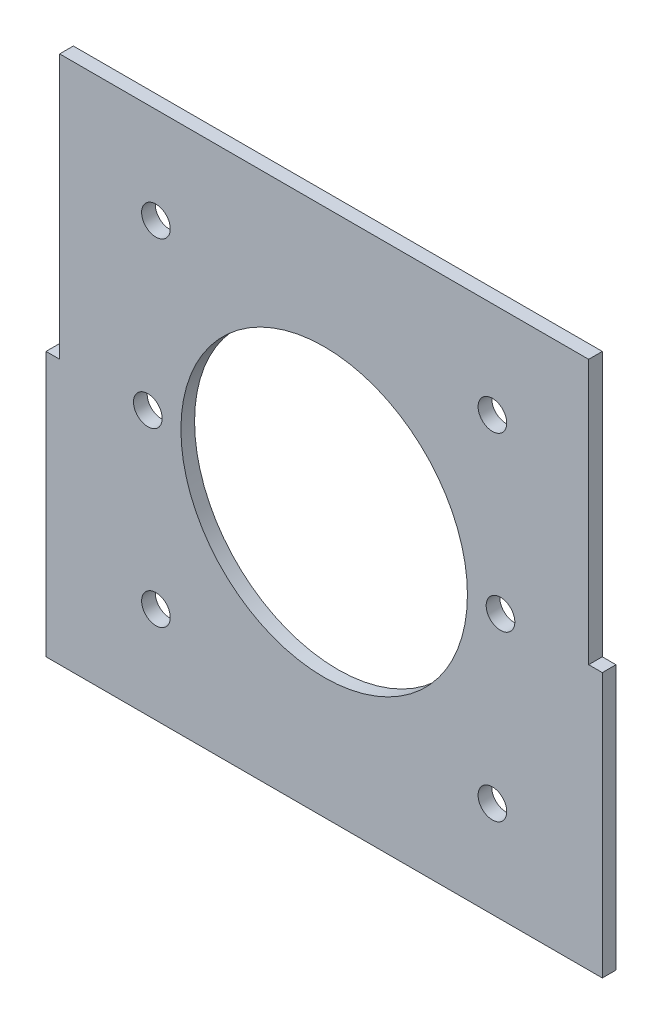
ISO-10303-21;
HEADER;
FILE_DESCRIPTION(('STEP AP214'),'2;1');
FILE_NAME('part.step','',(''),(''),'','','');
FILE_SCHEMA(('AUTOMOTIVE_DESIGN { 1 0 10303 214 1 1 1 1 }'));
ENDSEC;
DATA;
#1=APPLICATION_CONTEXT('core data for automotive mechanical design processes');
#2=APPLICATION_PROTOCOL_DEFINITION('international standard','automotive_design',2000,#1);
#3=PRODUCT_CONTEXT('',#1,'mechanical');
#4=PRODUCT('Part','Part','',(#3));
#5=PRODUCT_RELATED_PRODUCT_CATEGORY('part','',(#4));
#6=PRODUCT_DEFINITION_FORMATION('','',#4);
#7=PRODUCT_DEFINITION_CONTEXT('part definition',#1,'design');
#8=PRODUCT_DEFINITION('design','',#6,#7);
#9=PRODUCT_DEFINITION_SHAPE('','',#8);
#10=(LENGTH_UNIT() NAMED_UNIT(*) SI_UNIT(.MILLI.,.METRE.));
#11=(NAMED_UNIT(*) PLANE_ANGLE_UNIT() SI_UNIT($,.RADIAN.));
#12=(NAMED_UNIT(*) SI_UNIT($,.STERADIAN.) SOLID_ANGLE_UNIT());
#13=UNCERTAINTY_MEASURE_WITH_UNIT(LENGTH_MEASURE(1.E-05),#10,'distance_accuracy_value','');
#14=(GEOMETRIC_REPRESENTATION_CONTEXT(3) GLOBAL_UNCERTAINTY_ASSIGNED_CONTEXT((#13)) GLOBAL_UNIT_ASSIGNED_CONTEXT((#10,
#11,#12)) REPRESENTATION_CONTEXT('',''));
#15=CARTESIAN_POINT('',(0.,0.,0.));
#16=DIRECTION('',(0.,0.,1.));
#17=DIRECTION('',(1.,0.,0.));
#18=AXIS2_PLACEMENT_3D('',#15,#16,#17);
#19=CARTESIAN_POINT('',(60.,-60.,3.1));
#20=DIRECTION('',(-1.,0.,0.));
#21=DIRECTION('',(0.,-1.,0.));
#22=AXIS2_PLACEMENT_3D('',#19,#20,#21);
#23=PLANE('',#22);
#24=DIRECTION('',(0.,0.,1.));
#25=VECTOR('',#24,1.);
#26=CARTESIAN_POINT('',(60.,0.,0.));
#27=LINE('',#26,#25);
#28=CARTESIAN_POINT('',(60.,0.,0.));
#29=VERTEX_POINT('',#28);
#30=CARTESIAN_POINT('',(60.,0.,3.1));
#31=VERTEX_POINT('',#30);
#32=EDGE_CURVE('E56',#29,#31,#27,.T.);
#33=ORIENTED_EDGE('',*,*,#32,.F.);
#34=DIRECTION('',(0.,1.,0.));
#35=VECTOR('',#34,1.);
#36=CARTESIAN_POINT('',(60.,-60.,0.));
#37=LINE('',#36,#35);
#38=CARTESIAN_POINT('',(60.,60.,0.));
#39=VERTEX_POINT('',#38);
#40=EDGE_CURVE('E177',#29,#39,#37,.T.);
#41=ORIENTED_EDGE('',*,*,#40,.T.);
#42=DIRECTION('',(0.,0.,-1.));
#43=VECTOR('',#42,1.);
#44=CARTESIAN_POINT('',(60.,60.,3.1));
#45=LINE('',#44,#43);
#46=CARTESIAN_POINT('',(60.,60.,3.1));
#47=VERTEX_POINT('',#46);
#48=EDGE_CURVE('E11',#47,#39,#45,.T.);
#49=ORIENTED_EDGE('',*,*,#48,.F.);
#50=DIRECTION('',(0.,1.,0.));
#51=VECTOR('',#50,1.);
#52=CARTESIAN_POINT('',(60.,-60.,3.1));
#53=LINE('',#52,#51);
#54=EDGE_CURVE('E153',#31,#47,#53,.T.);
#55=ORIENTED_EDGE('',*,*,#54,.F.);
#56=EDGE_LOOP('',(#33,#41,#49,#55));
#57=FACE_BOUND('',#56,.T.);
#58=ADVANCED_FACE('F32',(#57),#23,.F.);
#59=CARTESIAN_POINT('',(0.,0.,3.1));
#60=DIRECTION('',(0.,0.,-1.));
#61=DIRECTION('',(-1.,0.,0.));
#62=AXIS2_PLACEMENT_3D('',#59,#60,#61);
#63=PLANE('',#62);
#64=CARTESIAN_POINT('',(0.,0.,3.1));
#65=DIRECTION('',(0.,0.,1.));
#66=DIRECTION('',(1.,0.,0.));
#67=AXIS2_PLACEMENT_3D('',#64,#65,#66);
#68=CIRCLE('',#67,32.5);
#69=CARTESIAN_POINT('',(32.5,0.,3.1));
#70=VERTEX_POINT('',#69);
#71=EDGE_CURVE('E419',#70,#70,#68,.T.);
#72=ORIENTED_EDGE('',*,*,#71,.F.);
#73=EDGE_LOOP('',(#72));
#74=FACE_BOUND('',#73,.T.);
#75=CARTESIAN_POINT('',(-40.,0.,3.1));
#76=DIRECTION('',(0.,0.,1.));
#77=DIRECTION('',(1.,0.,0.));
#78=AXIS2_PLACEMENT_3D('',#75,#76,#77);
#79=CIRCLE('',#78,3.25);
#80=CARTESIAN_POINT('',(-36.75,0.,3.1));
#81=VERTEX_POINT('',#80);
#82=EDGE_CURVE('E207',#81,#81,#79,.T.);
#83=ORIENTED_EDGE('',*,*,#82,.F.);
#84=EDGE_LOOP('',(#83));
#85=FACE_BOUND('',#84,.T.);
#86=CARTESIAN_POINT('',(38.1660885145439,-38.1660885145439,3.1));
#87=DIRECTION('',(0.,0.,1.));
#88=DIRECTION('',(1.,0.,0.));
#89=AXIS2_PLACEMENT_3D('',#86,#87,#88);
#90=CIRCLE('',#89,3.25);
#91=CARTESIAN_POINT('',(41.4160885145439,-38.1660885145439,3.1));
#92=VERTEX_POINT('',#91);
#93=EDGE_CURVE('E195',#92,#92,#90,.T.);
#94=ORIENTED_EDGE('',*,*,#93,.F.);
#95=EDGE_LOOP('',(#94));
#96=FACE_BOUND('',#95,.T.);
#97=CARTESIAN_POINT('',(-38.1660885145439,38.1660885145439,3.1));
#98=DIRECTION('',(0.,0.,1.));
#99=DIRECTION('',(1.,0.,0.));
#100=AXIS2_PLACEMENT_3D('',#97,#98,#99);
#101=CIRCLE('',#100,3.25);
#102=CARTESIAN_POINT('',(-34.9160885145439,38.1660885145439,3.1));
#103=VERTEX_POINT('',#102);
#104=EDGE_CURVE('E178',#103,#103,#101,.T.);
#105=ORIENTED_EDGE('',*,*,#104,.F.);
#106=EDGE_LOOP('',(#105));
#107=FACE_BOUND('',#106,.T.);
#108=DIRECTION('',(1.,0.,0.));
#109=VECTOR('',#108,1.);
#110=CARTESIAN_POINT('',(-60.,-60.,3.1));
#111=LINE('',#110,#109);
#112=CARTESIAN_POINT('',(-63.1,-60.,3.1));
#113=VERTEX_POINT('',#112);
#114=CARTESIAN_POINT('',(63.1,-60.,3.1));
#115=VERTEX_POINT('',#114);
#116=EDGE_CURVE('E176',#113,#115,#111,.T.);
#117=ORIENTED_EDGE('',*,*,#116,.T.);
#118=DIRECTION('',(0.,1.,0.));
#119=VECTOR('',#118,1.);
#120=CARTESIAN_POINT('',(63.1,0.,3.1));
#121=LINE('',#120,#119);
#122=CARTESIAN_POINT('',(63.1,0.,3.1));
#123=VERTEX_POINT('',#122);
#124=EDGE_CURVE('E137',#115,#123,#121,.T.);
#125=ORIENTED_EDGE('',*,*,#124,.T.);
#126=DIRECTION('',(-1.,0.,0.));
#127=VECTOR('',#126,1.);
#128=CARTESIAN_POINT('',(60.,0.,3.1));
#129=LINE('',#128,#127);
#130=EDGE_CURVE('E127',#123,#31,#129,.T.);
#131=ORIENTED_EDGE('',*,*,#130,.T.);
#132=ORIENTED_EDGE('',*,*,#54,.T.);
#133=DIRECTION('',(-1.,0.,0.));
#134=VECTOR('',#133,1.);
#135=CARTESIAN_POINT('',(-60.,60.,3.1));
#136=LINE('',#135,#134);
#137=CARTESIAN_POINT('',(-60.,60.,3.1));
#138=VERTEX_POINT('',#137);
#139=EDGE_CURVE('E183',#47,#138,#136,.T.);
#140=ORIENTED_EDGE('',*,*,#139,.T.);
#141=DIRECTION('',(0.,-1.,0.));
#142=VECTOR('',#141,1.);
#143=CARTESIAN_POINT('',(-60.,-60.,3.1));
#144=LINE('',#143,#142);
#145=CARTESIAN_POINT('',(-60.,0.,3.1));
#146=VERTEX_POINT('',#145);
#147=EDGE_CURVE('E168',#138,#146,#144,.T.);
#148=ORIENTED_EDGE('',*,*,#147,.T.);
#149=DIRECTION('',(-1.,0.,0.));
#150=VECTOR('',#149,1.);
#151=CARTESIAN_POINT('',(-60.,0.,3.1));
#152=LINE('',#151,#150);
#153=CARTESIAN_POINT('',(-63.1,0.,3.1));
#154=VERTEX_POINT('',#153);
#155=EDGE_CURVE('E48',#146,#154,#152,.T.);
#156=ORIENTED_EDGE('',*,*,#155,.T.);
#157=DIRECTION('',(0.,-1.,0.));
#158=VECTOR('',#157,1.);
#159=CARTESIAN_POINT('',(-63.1,0.,3.1));
#160=LINE('',#159,#158);
#161=EDGE_CURVE('E104',#154,#113,#160,.T.);
#162=ORIENTED_EDGE('',*,*,#161,.T.);
#163=EDGE_LOOP('',(#117,#125,#131,#132,#140,#148,#156,#162));
#164=FACE_BOUND('',#163,.T.);
#165=CARTESIAN_POINT('',(38.1660885145439,38.1660885145439,3.1));
#166=DIRECTION('',(0.,0.,1.));
#167=DIRECTION('',(1.,0.,0.));
#168=AXIS2_PLACEMENT_3D('',#165,#166,#167);
#169=CIRCLE('',#168,3.25);
#170=CARTESIAN_POINT('',(41.4160885145439,38.1660885145439,3.1));
#171=VERTEX_POINT('',#170);
#172=EDGE_CURVE('E189',#171,#171,#169,.T.);
#173=ORIENTED_EDGE('',*,*,#172,.F.);
#174=EDGE_LOOP('',(#173));
#175=FACE_BOUND('',#174,.T.);
#176=CARTESIAN_POINT('',(-38.1660885145439,-38.1660885145439,3.1));
#177=DIRECTION('',(0.,0.,1.));
#178=DIRECTION('',(1.,0.,0.));
#179=AXIS2_PLACEMENT_3D('',#176,#177,#178);
#180=CIRCLE('',#179,3.25);
#181=CARTESIAN_POINT('',(-34.9160885145439,-38.1660885145439,3.1));
#182=VERTEX_POINT('',#181);
#183=EDGE_CURVE('E201',#182,#182,#180,.T.);
#184=ORIENTED_EDGE('',*,*,#183,.F.);
#185=EDGE_LOOP('',(#184));
#186=FACE_BOUND('',#185,.T.);
#187=CARTESIAN_POINT('',(40.,0.,3.1));
#188=DIRECTION('',(0.,0.,1.));
#189=DIRECTION('',(-1.,0.,0.));
#190=AXIS2_PLACEMENT_3D('',#187,#188,#189);
#191=CIRCLE('',#190,3.25);
#192=CARTESIAN_POINT('',(36.75,0.,3.1));
#193=VERTEX_POINT('',#192);
#194=EDGE_CURVE('E148',#193,#193,#191,.T.);
#195=ORIENTED_EDGE('',*,*,#194,.F.);
#196=EDGE_LOOP('',(#195));
#197=FACE_BOUND('',#196,.T.);
#198=ADVANCED_FACE('F223',(#74,#85,#96,#107,#164,#175,#186,#197),#63,.F.);
#199=CARTESIAN_POINT('',(0.,0.,0.));
#200=DIRECTION('',(0.,0.,-1.));
#201=DIRECTION('',(-1.,0.,0.));
#202=AXIS2_PLACEMENT_3D('',#199,#200,#201);
#203=PLANE('',#202);
#204=CARTESIAN_POINT('',(0.,0.,0.));
#205=DIRECTION('',(0.,0.,-1.));
#206=DIRECTION('',(-1.,0.,0.));
#207=AXIS2_PLACEMENT_3D('',#204,#205,#206);
#208=CIRCLE('',#207,32.5);
#209=CARTESIAN_POINT('',(-32.5,0.,0.));
#210=VERTEX_POINT('',#209);
#211=EDGE_CURVE('E35',#210,#210,#208,.T.);
#212=ORIENTED_EDGE('',*,*,#211,.F.);
#213=EDGE_LOOP('',(#212));
#214=FACE_BOUND('',#213,.T.);
#215=CARTESIAN_POINT('',(-40.,0.,0.));
#216=DIRECTION('',(0.,0.,1.));
#217=DIRECTION('',(1.,0.,0.));
#218=AXIS2_PLACEMENT_3D('',#215,#216,#217);
#219=CIRCLE('',#218,3.25);
#220=CARTESIAN_POINT('',(-36.75,0.,0.));
#221=VERTEX_POINT('',#220);
#222=EDGE_CURVE('E210',#221,#221,#219,.T.);
#223=ORIENTED_EDGE('',*,*,#222,.T.);
#224=EDGE_LOOP('',(#223));
#225=FACE_BOUND('',#224,.T.);
#226=CARTESIAN_POINT('',(38.1660885145439,-38.1660885145439,0.));
#227=DIRECTION('',(0.,0.,1.));
#228=DIRECTION('',(1.,0.,0.));
#229=AXIS2_PLACEMENT_3D('',#226,#227,#228);
#230=CIRCLE('',#229,3.25);
#231=CARTESIAN_POINT('',(41.4160885145439,-38.1660885145439,0.));
#232=VERTEX_POINT('',#231);
#233=EDGE_CURVE('E198',#232,#232,#230,.T.);
#234=ORIENTED_EDGE('',*,*,#233,.T.);
#235=EDGE_LOOP('',(#234));
#236=FACE_BOUND('',#235,.T.);
#237=CARTESIAN_POINT('',(-38.1660885145439,38.1660885145439,0.));
#238=DIRECTION('',(0.,0.,1.));
#239=DIRECTION('',(1.,0.,0.));
#240=AXIS2_PLACEMENT_3D('',#237,#238,#239);
#241=CIRCLE('',#240,3.25);
#242=CARTESIAN_POINT('',(-34.9160885145439,38.1660885145439,0.));
#243=VERTEX_POINT('',#242);
#244=EDGE_CURVE('E186',#243,#243,#241,.T.);
#245=ORIENTED_EDGE('',*,*,#244,.T.);
#246=EDGE_LOOP('',(#245));
#247=FACE_BOUND('',#246,.T.);
#248=ORIENTED_EDGE('',*,*,#40,.F.);
#249=DIRECTION('',(-1.,0.,0.));
#250=VECTOR('',#249,1.);
#251=CARTESIAN_POINT('',(60.,0.,0.));
#252=LINE('',#251,#250);
#253=CARTESIAN_POINT('',(63.1,0.,0.));
#254=VERTEX_POINT('',#253);
#255=EDGE_CURVE('E136',#254,#29,#252,.T.);
#256=ORIENTED_EDGE('',*,*,#255,.F.);
#257=DIRECTION('',(0.,1.,0.));
#258=VECTOR('',#257,1.);
#259=CARTESIAN_POINT('',(63.1,0.,0.));
#260=LINE('',#259,#258);
#261=CARTESIAN_POINT('',(63.1,-60.,0.));
#262=VERTEX_POINT('',#261);
#263=EDGE_CURVE('E133',#262,#254,#260,.T.);
#264=ORIENTED_EDGE('',*,*,#263,.F.);
#265=DIRECTION('',(1.,0.,0.));
#266=VECTOR('',#265,1.);
#267=CARTESIAN_POINT('',(-60.,-60.,0.));
#268=LINE('',#267,#266);
#269=CARTESIAN_POINT('',(-63.1,-60.,0.));
#270=VERTEX_POINT('',#269);
#271=EDGE_CURVE('E116',#270,#262,#268,.T.);
#272=ORIENTED_EDGE('',*,*,#271,.F.);
#273=DIRECTION('',(0.,-1.,0.));
#274=VECTOR('',#273,1.);
#275=CARTESIAN_POINT('',(-63.1,0.,0.));
#276=LINE('',#275,#274);
#277=CARTESIAN_POINT('',(-63.1,0.,0.));
#278=VERTEX_POINT('',#277);
#279=EDGE_CURVE('E102',#278,#270,#276,.T.);
#280=ORIENTED_EDGE('',*,*,#279,.F.);
#281=DIRECTION('',(-1.,0.,0.));
#282=VECTOR('',#281,1.);
#283=CARTESIAN_POINT('',(-60.,0.,0.));
#284=LINE('',#283,#282);
#285=CARTESIAN_POINT('',(-60.,0.,0.));
#286=VERTEX_POINT('',#285);
#287=EDGE_CURVE('E113',#286,#278,#284,.T.);
#288=ORIENTED_EDGE('',*,*,#287,.F.);
#289=DIRECTION('',(0.,-1.,0.));
#290=VECTOR('',#289,1.);
#291=CARTESIAN_POINT('',(-60.,-60.,0.));
#292=LINE('',#291,#290);
#293=CARTESIAN_POINT('',(-60.,60.,0.));
#294=VERTEX_POINT('',#293);
#295=EDGE_CURVE('E164',#294,#286,#292,.T.);
#296=ORIENTED_EDGE('',*,*,#295,.F.);
#297=DIRECTION('',(-1.,0.,0.));
#298=VECTOR('',#297,1.);
#299=CARTESIAN_POINT('',(-60.,60.,0.));
#300=LINE('',#299,#298);
#301=EDGE_CURVE('E167',#39,#294,#300,.T.);
#302=ORIENTED_EDGE('',*,*,#301,.F.);
#303=EDGE_LOOP('',(#248,#256,#264,#272,#280,#288,#296,#302));
#304=FACE_BOUND('',#303,.T.);
#305=CARTESIAN_POINT('',(38.1660885145439,38.1660885145439,0.));
#306=DIRECTION('',(0.,0.,1.));
#307=DIRECTION('',(1.,0.,0.));
#308=AXIS2_PLACEMENT_3D('',#305,#306,#307);
#309=CIRCLE('',#308,3.25);
#310=CARTESIAN_POINT('',(41.4160885145439,38.1660885145439,0.));
#311=VERTEX_POINT('',#310);
#312=EDGE_CURVE('E192',#311,#311,#309,.T.);
#313=ORIENTED_EDGE('',*,*,#312,.T.);
#314=EDGE_LOOP('',(#313));
#315=FACE_BOUND('',#314,.T.);
#316=CARTESIAN_POINT('',(-38.1660885145439,-38.1660885145439,0.));
#317=DIRECTION('',(0.,0.,1.));
#318=DIRECTION('',(1.,0.,0.));
#319=AXIS2_PLACEMENT_3D('',#316,#317,#318);
#320=CIRCLE('',#319,3.25);
#321=CARTESIAN_POINT('',(-34.9160885145439,-38.1660885145439,0.));
#322=VERTEX_POINT('',#321);
#323=EDGE_CURVE('E204',#322,#322,#320,.T.);
#324=ORIENTED_EDGE('',*,*,#323,.T.);
#325=EDGE_LOOP('',(#324));
#326=FACE_BOUND('',#325,.T.);
#327=CARTESIAN_POINT('',(40.,0.,0.));
#328=DIRECTION('',(0.,0.,1.));
#329=DIRECTION('',(-1.,0.,0.));
#330=AXIS2_PLACEMENT_3D('',#327,#328,#329);
#331=CIRCLE('',#330,3.25);
#332=CARTESIAN_POINT('',(36.75,0.,0.));
#333=VERTEX_POINT('',#332);
#334=EDGE_CURVE('E142',#333,#333,#331,.T.);
#335=ORIENTED_EDGE('',*,*,#334,.T.);
#336=EDGE_LOOP('',(#335));
#337=FACE_BOUND('',#336,.T.);
#338=ADVANCED_FACE('F110',(#214,#225,#236,#247,#304,#315,#326,#337),#203,.T.);
#339=CARTESIAN_POINT('',(-60.,60.,3.1));
#340=DIRECTION('',(0.,-1.,0.));
#341=DIRECTION('',(1.,0.,0.));
#342=AXIS2_PLACEMENT_3D('',#339,#340,#341);
#343=PLANE('',#342);
#344=ORIENTED_EDGE('',*,*,#301,.T.);
#345=DIRECTION('',(0.,0.,-1.));
#346=VECTOR('',#345,1.);
#347=CARTESIAN_POINT('',(-60.,60.,3.1));
#348=LINE('',#347,#346);
#349=EDGE_CURVE('E40',#138,#294,#348,.T.);
#350=ORIENTED_EDGE('',*,*,#349,.F.);
#351=ORIENTED_EDGE('',*,*,#139,.F.);
#352=ORIENTED_EDGE('',*,*,#48,.T.);
#353=EDGE_LOOP('',(#344,#350,#351,#352));
#354=FACE_BOUND('',#353,.T.);
#355=ADVANCED_FACE('F231',(#354),#343,.F.);
#356=CARTESIAN_POINT('',(-60.,-60.,3.1));
#357=DIRECTION('',(1.,0.,0.));
#358=DIRECTION('',(0.,1.,0.));
#359=AXIS2_PLACEMENT_3D('',#356,#357,#358);
#360=PLANE('',#359);
#361=ORIENTED_EDGE('',*,*,#295,.T.);
#362=DIRECTION('',(0.,0.,1.));
#363=VECTOR('',#362,1.);
#364=CARTESIAN_POINT('',(-60.,0.,0.));
#365=LINE('',#364,#363);
#366=EDGE_CURVE('E120',#286,#146,#365,.T.);
#367=ORIENTED_EDGE('',*,*,#366,.T.);
#368=ORIENTED_EDGE('',*,*,#147,.F.);
#369=ORIENTED_EDGE('',*,*,#349,.T.);
#370=EDGE_LOOP('',(#361,#367,#368,#369));
#371=FACE_BOUND('',#370,.T.);
#372=ADVANCED_FACE('F243',(#371),#360,.F.);
#373=CARTESIAN_POINT('',(-60.,-60.,3.1));
#374=DIRECTION('',(0.,1.,0.));
#375=DIRECTION('',(-1.,0.,0.));
#376=AXIS2_PLACEMENT_3D('',#373,#374,#375);
#377=PLANE('',#376);
#378=ORIENTED_EDGE('',*,*,#271,.T.);
#379=DIRECTION('',(0.,0.,1.));
#380=VECTOR('',#379,1.);
#381=CARTESIAN_POINT('',(63.1,-60.,0.));
#382=LINE('',#381,#380);
#383=EDGE_CURVE('E143',#262,#115,#382,.T.);
#384=ORIENTED_EDGE('',*,*,#383,.T.);
#385=ORIENTED_EDGE('',*,*,#116,.F.);
#386=DIRECTION('',(0.,0.,1.));
#387=VECTOR('',#386,1.);
#388=CARTESIAN_POINT('',(-63.1,-60.,0.));
#389=LINE('',#388,#387);
#390=EDGE_CURVE('E106',#270,#113,#389,.T.);
#391=ORIENTED_EDGE('',*,*,#390,.F.);
#392=EDGE_LOOP('',(#378,#384,#385,#391));
#393=FACE_BOUND('',#392,.T.);
#394=ADVANCED_FACE('F240',(#393),#377,.F.);
#395=CARTESIAN_POINT('',(-38.1660885145439,38.1660885145439,3.1));
#396=DIRECTION('',(0.,0.,-1.));
#397=DIRECTION('',(-1.,0.,0.));
#398=AXIS2_PLACEMENT_3D('',#395,#396,#397);
#399=CYLINDRICAL_SURFACE('',#398,3.25);
#400=ORIENTED_EDGE('',*,*,#104,.T.);
#401=EDGE_LOOP('',(#400));
#402=FACE_BOUND('',#401,.T.);
#403=ORIENTED_EDGE('',*,*,#244,.F.);
#404=EDGE_LOOP('',(#403));
#405=FACE_BOUND('',#404,.T.);
#406=ADVANCED_FACE('F237',(#402,#405),#399,.F.);
#407=CARTESIAN_POINT('',(38.1660885145439,38.1660885145439,3.1));
#408=DIRECTION('',(0.,0.,-1.));
#409=DIRECTION('',(-1.,0.,0.));
#410=AXIS2_PLACEMENT_3D('',#407,#408,#409);
#411=CYLINDRICAL_SURFACE('',#410,3.25);
#412=ORIENTED_EDGE('',*,*,#172,.T.);
#413=EDGE_LOOP('',(#412));
#414=FACE_BOUND('',#413,.T.);
#415=ORIENTED_EDGE('',*,*,#312,.F.);
#416=EDGE_LOOP('',(#415));
#417=FACE_BOUND('',#416,.T.);
#418=ADVANCED_FACE('F289',(#414,#417),#411,.F.);
#419=CARTESIAN_POINT('',(38.1660885145439,-38.1660885145439,3.1));
#420=DIRECTION('',(0.,0.,-1.));
#421=DIRECTION('',(-1.,0.,0.));
#422=AXIS2_PLACEMENT_3D('',#419,#420,#421);
#423=CYLINDRICAL_SURFACE('',#422,3.25);
#424=ORIENTED_EDGE('',*,*,#93,.T.);
#425=EDGE_LOOP('',(#424));
#426=FACE_BOUND('',#425,.T.);
#427=ORIENTED_EDGE('',*,*,#233,.F.);
#428=EDGE_LOOP('',(#427));
#429=FACE_BOUND('',#428,.T.);
#430=ADVANCED_FACE('F286',(#426,#429),#423,.F.);
#431=CARTESIAN_POINT('',(-38.1660885145439,-38.1660885145439,3.1));
#432=DIRECTION('',(0.,0.,-1.));
#433=DIRECTION('',(-1.,0.,0.));
#434=AXIS2_PLACEMENT_3D('',#431,#432,#433);
#435=CYLINDRICAL_SURFACE('',#434,3.25);
#436=ORIENTED_EDGE('',*,*,#183,.T.);
#437=EDGE_LOOP('',(#436));
#438=FACE_BOUND('',#437,.T.);
#439=ORIENTED_EDGE('',*,*,#323,.F.);
#440=EDGE_LOOP('',(#439));
#441=FACE_BOUND('',#440,.T.);
#442=ADVANCED_FACE('F282',(#438,#441),#435,.F.);
#443=CARTESIAN_POINT('',(-40.,0.,3.1));
#444=DIRECTION('',(0.,0.,-1.));
#445=DIRECTION('',(-1.,0.,0.));
#446=AXIS2_PLACEMENT_3D('',#443,#444,#445);
#447=CYLINDRICAL_SURFACE('',#446,3.25);
#448=ORIENTED_EDGE('',*,*,#82,.T.);
#449=EDGE_LOOP('',(#448));
#450=FACE_BOUND('',#449,.T.);
#451=ORIENTED_EDGE('',*,*,#222,.F.);
#452=EDGE_LOOP('',(#451));
#453=FACE_BOUND('',#452,.T.);
#454=ADVANCED_FACE('F279',(#450,#453),#447,.F.);
#455=CARTESIAN_POINT('',(40.,0.,3.1));
#456=DIRECTION('',(0.,0.,-1.));
#457=DIRECTION('',(-1.,0.,0.));
#458=AXIS2_PLACEMENT_3D('',#455,#456,#457);
#459=CYLINDRICAL_SURFACE('',#458,3.25);
#460=ORIENTED_EDGE('',*,*,#194,.T.);
#461=EDGE_LOOP('',(#460));
#462=FACE_BOUND('',#461,.T.);
#463=ORIENTED_EDGE('',*,*,#334,.F.);
#464=EDGE_LOOP('',(#463));
#465=FACE_BOUND('',#464,.T.);
#466=ADVANCED_FACE('F220',(#462,#465),#459,.F.);
#467=CARTESIAN_POINT('',(60.,0.,0.));
#468=DIRECTION('',(0.,1.,0.));
#469=DIRECTION('',(-1.,0.,0.));
#470=AXIS2_PLACEMENT_3D('',#467,#468,#469);
#471=PLANE('',#470);
#472=ORIENTED_EDGE('',*,*,#130,.F.);
#473=DIRECTION('',(0.,0.,1.));
#474=VECTOR('',#473,1.);
#475=CARTESIAN_POINT('',(63.1,0.,0.));
#476=LINE('',#475,#474);
#477=EDGE_CURVE('E140',#254,#123,#476,.T.);
#478=ORIENTED_EDGE('',*,*,#477,.F.);
#479=ORIENTED_EDGE('',*,*,#255,.T.);
#480=ORIENTED_EDGE('',*,*,#32,.T.);
#481=EDGE_LOOP('',(#472,#478,#479,#480));
#482=FACE_BOUND('',#481,.T.);
#483=ADVANCED_FACE('F262',(#482),#471,.T.);
#484=CARTESIAN_POINT('',(63.1,0.,0.));
#485=DIRECTION('',(1.,0.,0.));
#486=DIRECTION('',(0.,0.,-1.));
#487=AXIS2_PLACEMENT_3D('',#484,#485,#486);
#488=PLANE('',#487);
#489=ORIENTED_EDGE('',*,*,#124,.F.);
#490=ORIENTED_EDGE('',*,*,#383,.F.);
#491=ORIENTED_EDGE('',*,*,#263,.T.);
#492=ORIENTED_EDGE('',*,*,#477,.T.);
#493=EDGE_LOOP('',(#489,#490,#491,#492));
#494=FACE_BOUND('',#493,.T.);
#495=ADVANCED_FACE('F265',(#494),#488,.T.);
#496=CARTESIAN_POINT('',(-60.,0.,0.));
#497=DIRECTION('',(0.,1.,0.));
#498=DIRECTION('',(-1.,0.,0.));
#499=AXIS2_PLACEMENT_3D('',#496,#497,#498);
#500=PLANE('',#499);
#501=ORIENTED_EDGE('',*,*,#155,.F.);
#502=ORIENTED_EDGE('',*,*,#366,.F.);
#503=ORIENTED_EDGE('',*,*,#287,.T.);
#504=DIRECTION('',(0.,0.,1.));
#505=VECTOR('',#504,1.);
#506=CARTESIAN_POINT('',(-63.1,0.,0.));
#507=LINE('',#506,#505);
#508=EDGE_CURVE('E98',#278,#154,#507,.T.);
#509=ORIENTED_EDGE('',*,*,#508,.T.);
#510=EDGE_LOOP('',(#501,#502,#503,#509));
#511=FACE_BOUND('',#510,.T.);
#512=ADVANCED_FACE('F119',(#511),#500,.T.);
#513=CARTESIAN_POINT('',(-63.1,0.,0.));
#514=DIRECTION('',(-1.,0.,0.));
#515=DIRECTION('',(0.,-1.,0.));
#516=AXIS2_PLACEMENT_3D('',#513,#514,#515);
#517=PLANE('',#516);
#518=ORIENTED_EDGE('',*,*,#161,.F.);
#519=ORIENTED_EDGE('',*,*,#508,.F.);
#520=ORIENTED_EDGE('',*,*,#279,.T.);
#521=ORIENTED_EDGE('',*,*,#390,.T.);
#522=EDGE_LOOP('',(#518,#519,#520,#521));
#523=FACE_BOUND('',#522,.T.);
#524=ADVANCED_FACE('F100',(#523),#517,.T.);
#525=CARTESIAN_POINT('',(0.,0.,-5.00000000001367E-05));
#526=DIRECTION('',(0.,0.,1.));
#527=DIRECTION('',(1.,0.,0.));
#528=AXIS2_PLACEMENT_3D('',#525,#526,#527);
#529=CYLINDRICAL_SURFACE('',#528,32.5);
#530=ORIENTED_EDGE('',*,*,#211,.T.);
#531=EDGE_LOOP('',(#530));
#532=FACE_BOUND('',#531,.T.);
#533=ORIENTED_EDGE('',*,*,#71,.T.);
#534=EDGE_LOOP('',(#533));
#535=FACE_BOUND('',#534,.T.);
#536=ADVANCED_FACE('F386',(#532,#535),#529,.F.);
#537=CLOSED_SHELL('',(#58,#198,#338,#355,#372,#394,#406,#418,#430,#442,#454,#466,#483,#495,#512,
#524,#536));
#538=MANIFOLD_SOLID_BREP('B2',#537);
#539=ADVANCED_BREP_SHAPE_REPRESENTATION('',(#18,#538),#14);
#540=SHAPE_DEFINITION_REPRESENTATION(#9,#539);
ENDSEC;
END-ISO-10303-21;
